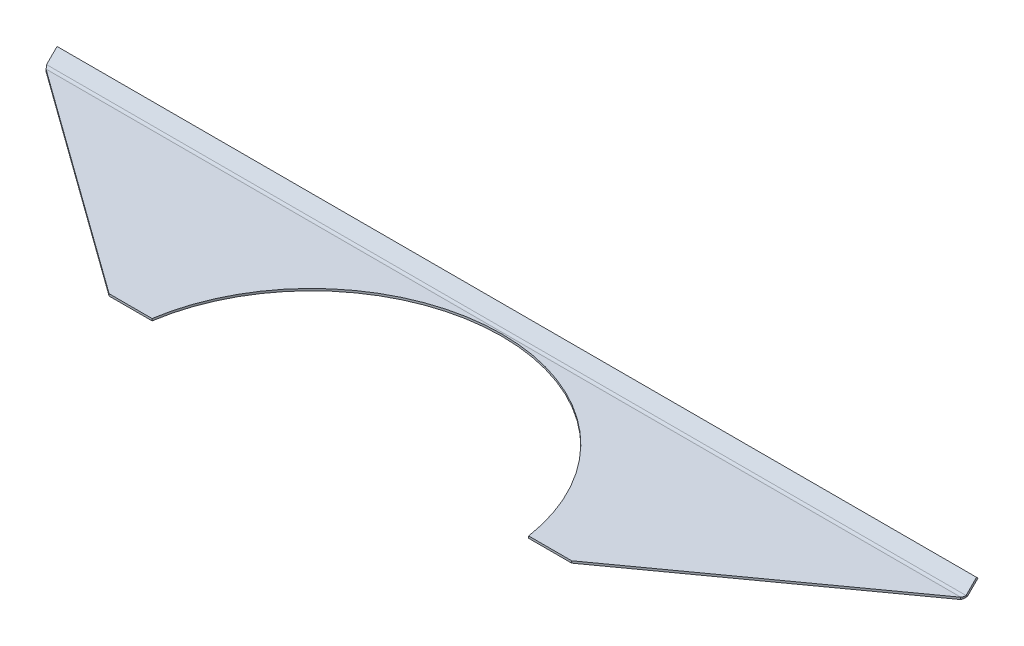
ISO-10303-21;
HEADER;
FILE_DESCRIPTION(('STEP AP214'),'2;1');
FILE_NAME('part.step','',(''),(''),'','','');
FILE_SCHEMA(('AUTOMOTIVE_DESIGN { 1 0 10303 214 1 1 1 1 }'));
ENDSEC;
DATA;
#1=APPLICATION_CONTEXT('core data for automotive mechanical design processes');
#2=APPLICATION_PROTOCOL_DEFINITION('international standard','automotive_design',2000,#1);
#3=PRODUCT_CONTEXT('',#1,'mechanical');
#4=PRODUCT('Part','Part','',(#3));
#5=PRODUCT_RELATED_PRODUCT_CATEGORY('part','',(#4));
#6=PRODUCT_DEFINITION_FORMATION('','',#4);
#7=PRODUCT_DEFINITION_CONTEXT('part definition',#1,'design');
#8=PRODUCT_DEFINITION('design','',#6,#7);
#9=PRODUCT_DEFINITION_SHAPE('','',#8);
#10=(LENGTH_UNIT() NAMED_UNIT(*) SI_UNIT(.MILLI.,.METRE.));
#11=(NAMED_UNIT(*) PLANE_ANGLE_UNIT() SI_UNIT($,.RADIAN.));
#12=(NAMED_UNIT(*) SI_UNIT($,.STERADIAN.) SOLID_ANGLE_UNIT());
#13=UNCERTAINTY_MEASURE_WITH_UNIT(LENGTH_MEASURE(1.E-05),#10,'distance_accuracy_value','');
#14=(GEOMETRIC_REPRESENTATION_CONTEXT(3) GLOBAL_UNCERTAINTY_ASSIGNED_CONTEXT((#13)) GLOBAL_UNIT_ASSIGNED_CONTEXT((#10,
#11,#12)) REPRESENTATION_CONTEXT('',''));
#15=CARTESIAN_POINT('',(0.,0.,0.));
#16=DIRECTION('',(0.,0.,1.));
#17=DIRECTION('',(1.,0.,0.));
#18=AXIS2_PLACEMENT_3D('',#15,#16,#17);
#19=CARTESIAN_POINT('',(0.193817430499996,-1.5875,0.));
#20=DIRECTION('',(0.,1.,0.));
#21=DIRECTION('',(0.,0.,1.));
#22=AXIS2_PLACEMENT_3D('',#19,#20,#21);
#23=PLANE('',#22);
#24=DIRECTION('',(-1.,0.,0.));
#25=VECTOR('',#24,1.);
#26=CARTESIAN_POINT('',(-203.2,-1.58750000000004,-22.225));
#27=LINE('',#26,#25);
#28=CARTESIAN_POINT('',(177.465441421512,-1.5875,-22.225));
#29=VERTEX_POINT('',#28);
#30=CARTESIAN_POINT('',(144.5428800357,-1.5875,-22.225));
#31=VERTEX_POINT('',#30);
#32=EDGE_CURVE('E57',#29,#31,#27,.T.);
#33=ORIENTED_EDGE('',*,*,#32,.T.);
#34=CARTESIAN_POINT('',(0.193817430499996,-1.5875,0.));
#35=DIRECTION('',(0.,-1.,0.));
#36=DIRECTION('',(0.,0.,1.));
#37=AXIS2_PLACEMENT_3D('',#34,#35,#36);
#38=CIRCLE('',#37,146.05);
#39=CARTESIAN_POINT('',(-144.1552451747,-1.5875,-22.225));
#40=VERTEX_POINT('',#39);
#41=EDGE_CURVE('E49',#40,#31,#38,.T.);
#42=ORIENTED_EDGE('',*,*,#41,.F.);
#43=DIRECTION('',(1.,0.,0.));
#44=VECTOR('',#43,1.);
#45=CARTESIAN_POINT('',(0.193817430499996,-1.5875,-22.225));
#46=LINE('',#45,#44);
#47=CARTESIAN_POINT('',(-177.077806560512,-1.5875,-22.225));
#48=VERTEX_POINT('',#47);
#49=EDGE_CURVE('E65',#40,#48,#46,.F.);
#50=ORIENTED_EDGE('',*,*,#49,.T.);
#51=DIRECTION('',(0.811228232083333,0.,0.584729643058182));
#52=VECTOR('',#51,1.);
#53=CARTESIAN_POINT('',(-352.2311825695,-1.5875,-148.474761760819));
#54=LINE('',#53,#52);
#55=CARTESIAN_POINT('',(-350.406631643826,-1.58750000000004,-147.159633700284));
#56=VERTEX_POINT('',#55);
#57=EDGE_CURVE('E137',#56,#48,#54,.T.);
#58=ORIENTED_EDGE('',*,*,#57,.F.);
#59=DIRECTION('',(-1.,0.,0.));
#60=VECTOR('',#59,1.);
#61=CARTESIAN_POINT('',(-352.2311825695,-1.58750000000004,-147.159633700284));
#62=LINE('',#61,#60);
#63=CARTESIAN_POINT('',(350.794266504826,-1.5875,-147.159633700284));
#64=VERTEX_POINT('',#63);
#65=EDGE_CURVE('E195',#56,#64,#62,.F.);
#66=ORIENTED_EDGE('',*,*,#65,.T.);
#67=DIRECTION('',(0.811228232083333,0.,-0.584729643058182));
#68=VECTOR('',#67,1.);
#69=CARTESIAN_POINT('',(146.6314522915,-1.5875,0.));
#70=LINE('',#69,#68);
#71=EDGE_CURVE('E11',#29,#64,#70,.T.);
#72=ORIENTED_EDGE('',*,*,#71,.F.);
#73=EDGE_LOOP('',(#33,#42,#50,#58,#66,#72));
#74=FACE_BOUND('',#73,.T.);
#75=ADVANCED_FACE('F40',(#74),#23,.F.);
#76=CARTESIAN_POINT('',(0.193817430499996,0.,0.));
#77=DIRECTION('',(0.,1.,0.));
#78=DIRECTION('',(0.,0.,1.));
#79=AXIS2_PLACEMENT_3D('',#76,#77,#78);
#80=PLANE('',#79);
#81=CARTESIAN_POINT('',(0.193817430499996,0.,0.));
#82=DIRECTION('',(0.,-1.,0.));
#83=DIRECTION('',(0.,0.,1.));
#84=AXIS2_PLACEMENT_3D('',#81,#82,#83);
#85=CIRCLE('',#84,146.05);
#86=CARTESIAN_POINT('',(-144.1552451747,0.,-22.225));
#87=VERTEX_POINT('',#86);
#88=CARTESIAN_POINT('',(144.5428800357,0.,-22.225));
#89=VERTEX_POINT('',#88);
#90=EDGE_CURVE('E129',#87,#89,#85,.T.);
#91=ORIENTED_EDGE('',*,*,#90,.T.);
#92=DIRECTION('',(1.,0.,0.));
#93=VECTOR('',#92,1.);
#94=CARTESIAN_POINT('',(0.193817430499996,0.,-22.225));
#95=LINE('',#94,#93);
#96=CARTESIAN_POINT('',(177.465441421513,0.,-22.225));
#97=VERTEX_POINT('',#96);
#98=EDGE_CURVE('E116',#97,#89,#95,.F.);
#99=ORIENTED_EDGE('',*,*,#98,.F.);
#100=DIRECTION('',(0.811228232083333,0.,-0.584729643058182));
#101=VECTOR('',#100,1.);
#102=CARTESIAN_POINT('',(146.6314522915,0.,0.));
#103=LINE('',#102,#101);
#104=CARTESIAN_POINT('',(350.794266504826,0.,-147.159633700284));
#105=VERTEX_POINT('',#104);
#106=EDGE_CURVE('E44',#97,#105,#103,.T.);
#107=ORIENTED_EDGE('',*,*,#106,.T.);
#108=DIRECTION('',(-1.,0.,0.));
#109=VECTOR('',#108,1.);
#110=CARTESIAN_POINT('',(-352.2311825695,0.,-147.159633700284));
#111=LINE('',#110,#109);
#112=CARTESIAN_POINT('',(-350.406631643826,0.,-147.159633700284));
#113=VERTEX_POINT('',#112);
#114=EDGE_CURVE('E152',#113,#105,#111,.F.);
#115=ORIENTED_EDGE('',*,*,#114,.F.);
#116=DIRECTION('',(0.811228232083333,0.,0.584729643058182));
#117=VECTOR('',#116,1.);
#118=CARTESIAN_POINT('',(-352.2311825695,0.,-148.474761760819));
#119=LINE('',#118,#117);
#120=CARTESIAN_POINT('',(-177.077806560512,0.,-22.225));
#121=VERTEX_POINT('',#120);
#122=EDGE_CURVE('E136',#113,#121,#119,.T.);
#123=ORIENTED_EDGE('',*,*,#122,.T.);
#124=DIRECTION('',(-1.,0.,0.));
#125=VECTOR('',#124,1.);
#126=CARTESIAN_POINT('',(-203.2,0.,-22.225));
#127=LINE('',#126,#125);
#128=EDGE_CURVE('E131',#87,#121,#127,.T.);
#129=ORIENTED_EDGE('',*,*,#128,.F.);
#130=EDGE_LOOP('',(#91,#99,#107,#115,#123,#129));
#131=FACE_BOUND('',#130,.T.);
#132=ADVANCED_FACE('F134',(#131),#80,.T.);
#133=CARTESIAN_POINT('',(0.193817430499996,-1.5875,0.));
#134=DIRECTION('',(0.,1.,0.));
#135=DIRECTION('',(0.,0.,1.));
#136=AXIS2_PLACEMENT_3D('',#133,#134,#135);
#137=CYLINDRICAL_SURFACE('',#136,146.05);
#138=ORIENTED_EDGE('',*,*,#41,.T.);
#139=DIRECTION('',(0.,-1.,0.));
#140=VECTOR('',#139,1.);
#141=CARTESIAN_POINT('',(144.5428800357,-1.5875,-22.225));
#142=LINE('',#141,#140);
#143=EDGE_CURVE('E119',#31,#89,#142,.F.);
#144=ORIENTED_EDGE('',*,*,#143,.T.);
#145=ORIENTED_EDGE('',*,*,#90,.F.);
#146=DIRECTION('',(0.,1.,0.));
#147=VECTOR('',#146,1.);
#148=CARTESIAN_POINT('',(-144.1552451747,0.,-22.225));
#149=LINE('',#148,#147);
#150=EDGE_CURVE('E227',#87,#40,#149,.F.);
#151=ORIENTED_EDGE('',*,*,#150,.T.);
#152=EDGE_LOOP('',(#138,#144,#145,#151));
#153=FACE_BOUND('',#152,.T.);
#154=ADVANCED_FACE('F128',(#153),#137,.F.);
#155=CARTESIAN_POINT('',(146.6314522915,-1.5875,0.));
#156=DIRECTION('',(0.584729643058182,0.,0.811228232083333));
#157=DIRECTION('',(0.811228232083333,0.,-0.584729643058182));
#158=AXIS2_PLACEMENT_3D('',#155,#156,#157);
#159=PLANE('',#158);
#160=ORIENTED_EDGE('',*,*,#106,.F.);
#161=DIRECTION('',(0.,-1.,0.));
#162=VECTOR('',#161,1.);
#163=CARTESIAN_POINT('',(177.465441421513,-1.58750000000004,-22.225));
#164=LINE('',#163,#162);
#165=EDGE_CURVE('E120',#29,#97,#164,.F.);
#166=ORIENTED_EDGE('',*,*,#165,.F.);
#167=ORIENTED_EDGE('',*,*,#71,.T.);
#168=DIRECTION('',(0.,-1.,0.));
#169=VECTOR('',#168,1.);
#170=CARTESIAN_POINT('',(350.794266504826,0.,-147.159633700284));
#171=LINE('',#170,#169);
#172=EDGE_CURVE('E138',#105,#64,#171,.T.);
#173=ORIENTED_EDGE('',*,*,#172,.F.);
#174=EDGE_LOOP('',(#160,#166,#167,#173));
#175=FACE_BOUND('',#174,.T.);
#176=ADVANCED_FACE('F292',(#175),#159,.T.);
#177=CARTESIAN_POINT('',(-352.2311825695,-1.5875,-148.474761760819));
#178=DIRECTION('',(-0.584729643058182,0.,0.811228232083333));
#179=DIRECTION('',(0.811228232083333,0.,0.584729643058182));
#180=AXIS2_PLACEMENT_3D('',#177,#178,#179);
#181=PLANE('',#180);
#182=ORIENTED_EDGE('',*,*,#57,.T.);
#183=DIRECTION('',(0.,1.,0.));
#184=VECTOR('',#183,1.);
#185=CARTESIAN_POINT('',(-177.077806560512,0.,-22.225));
#186=LINE('',#185,#184);
#187=EDGE_CURVE('E229',#121,#48,#186,.F.);
#188=ORIENTED_EDGE('',*,*,#187,.F.);
#189=ORIENTED_EDGE('',*,*,#122,.F.);
#190=DIRECTION('',(0.,-1.,0.));
#191=VECTOR('',#190,1.);
#192=CARTESIAN_POINT('',(-350.406631643826,0.,-147.159633700284));
#193=LINE('',#192,#191);
#194=EDGE_CURVE('E194',#113,#56,#193,.T.);
#195=ORIENTED_EDGE('',*,*,#194,.T.);
#196=EDGE_LOOP('',(#182,#188,#189,#195));
#197=FACE_BOUND('',#196,.T.);
#198=ADVANCED_FACE('F42',(#197),#181,.T.);
#199=CARTESIAN_POINT('',(350.794266504826,-1.60337499999999,-147.159633700284));
#200=CARTESIAN_POINT('',(351.098402700509,-1.60337499999999,-147.785212740502));
#201=CARTESIAN_POINT('',(351.402450146718,-1.47900668887496,-148.410363247209));
#202=CARTESIAN_POINT('',(352.010633788609,-1.00027903345227,-149.566114045614));
#203=CARTESIAN_POINT('',(352.314681234817,-0.64617254705847,-150.09610388433));
#204=CARTESIAN_POINT('',(352.6188174305,-0.203821365552261,-150.538455065836));
#205=CARTESIAN_POINT('',(350.794266504826,-1.58749999999999,-147.159633700284));
#206=CARTESIAN_POINT('',(351.098402614715,-1.58749999999999,-147.783134287953));
#207=CARTESIAN_POINT('',(351.402450146718,-1.46354487263285,-148.406207999545));
#208=CARTESIAN_POINT('',(352.010633788609,-0.986407674537149,-149.5581190943));
#209=CARTESIAN_POINT('',(352.314681320612,-0.633477539015848,-150.08634825207));
#210=CARTESIAN_POINT('',(352.6188174305,-0.192596045400925,-150.527229745685));
#211=CARTESIAN_POINT('',(350.794266504826,0.,-147.159633700284));
#212=CARTESIAN_POINT('',(351.098394035298,0.,-147.575289033122));
#213=CARTESIAN_POINT('',(351.402450146718,0.0826367515781052,-147.990683233125));
#214=CARTESIAN_POINT('',(352.010633788609,0.40072821697524,-148.758623962962));
#215=CARTESIAN_POINT('',(352.314689900028,0.636023265246396,-149.110785026065));
#216=CARTESIAN_POINT('',(352.6188174305,0.929935969732723,-149.404697730551));
#217=CARTESIAN_POINT('',(350.794266504826,0.0160337500000069,-147.159633700284));
#218=CARTESIAN_POINT('',(351.098393948646,0.0160337500000069,-147.573189796049));
#219=CARTESIAN_POINT('',(351.402450146718,0.0982531859826358,-147.986486432984));
#220=CARTESIAN_POINT('',(352.010633788609,0.414738289479515,-148.750549062135));
#221=CARTESIAN_POINT('',(352.31468998668,0.648845223369445,-149.100931837482));
#222=CARTESIAN_POINT('',(352.6188174305,0.941273543085573,-149.393360157198));
#223=B_SPLINE_SURFACE_WITH_KNOTS('',1,3,((#199,#200,#201,#202,#203,#204),(#205,#206,#207,#208,
#209,#210),(#211,#212,#213,#214,#215,#216),(#217,#218,#219,#220,#221,#222)),.UNSPECIFIED.,.F.,
.F.,.F.,(2,1,1,2),(4,2,4),(-0.01,0.,1.,1.0101),(0.,0.5,1.),.UNSPECIFIED.);
#224=DIRECTION('',(0.,-0.707106781186551,-0.707106781186544));
#225=VECTOR('',#224,1.);
#226=CARTESIAN_POINT('',(352.6188174305,0.929935969732718,-149.404697730551));
#227=LINE('',#226,#225);
#228=CARTESIAN_POINT('',(352.6188174305,0.929935969732718,-149.404697730551));
#229=VERTEX_POINT('',#228);
#230=CARTESIAN_POINT('',(352.6188174305,-0.192596045400929,-150.527229745685));
#231=VERTEX_POINT('',#230);
#232=EDGE_CURVE('E234',#229,#231,#227,.T.);
#233=CARTESIAN_POINT('',(350.794266504826,0.,-147.159633700284));
#234=CARTESIAN_POINT('',(350.874092618561,-2.16495811624445E-05,-147.268726582998));
#235=CARTESIAN_POINT('',(350.953915580089,0.00562164434472559,-147.37781840919));
#236=CARTESIAN_POINT('',(351.113514977078,0.0280782573932783,-147.594788958531));
#237=CARTESIAN_POINT('',(351.193291414189,0.0448854877517528,-147.702668310362));
#238=CARTESIAN_POINT('',(351.352851558573,0.0895123907407566,-147.916133725762));
#239=CARTESIAN_POINT('',(351.432635265869,0.117333032673918,-148.021719586616));
#240=CARTESIAN_POINT('',(351.592237538962,0.18369788114791,-148.229508733181));
#241=CARTESIAN_POINT('',(351.672056106751,0.222246043726966,-148.33171075543));
#242=CARTESIAN_POINT('',(351.823998930517,0.3054389651289,-148.521971363189));
#243=CARTESIAN_POINT('',(351.896123854382,0.349138994201814,-148.61044411284));
#244=CARTESIAN_POINT('',(352.04039501697,0.444595923935233,-148.782976559996));
#245=CARTESIAN_POINT('',(352.112541254678,0.496355536493873,-148.867034759309));
#246=CARTESIAN_POINT('',(352.257050511619,0.607639109949298,-149.030210824732));
#247=CARTESIAN_POINT('',(352.329413534258,0.667185815686344,-149.10931317347));
#248=CARTESIAN_POINT('',(352.474122898102,0.793372721653697,-149.261603542027));
#249=CARTESIAN_POINT('',(352.546469238666,0.860011044829545,-149.334793117898));
#250=CARTESIAN_POINT('',(352.6188174305,0.929935969732723,-149.404697730551));
#251=B_SPLINE_CURVE_WITH_KNOTS('',3,(#233,#234,#235,#236,#237,#238,#239,#240,#241,#242,#243,
#244,#245,#246,#247,#248,#249,#250),.UNSPECIFIED.,.F.,.F.,(4,2,2,2,2,2,2,2,4),(0.,
0.405416763424114,0.810612595597231,1.21584409743855,1.6212252368886,1.98756386072292,
2.35402601804371,2.72158351255081,3.08904396044003),.UNSPECIFIED.);
#252=EDGE_CURVE('E154',#105,#229,#251,.T.);
#253=CARTESIAN_POINT('',(350.794266504826,-1.58749999999999,-147.159633700284));
#254=CARTESIAN_POINT('',(350.867104149607,-1.58752215778612,-147.308948616645));
#255=CARTESIAN_POINT('',(350.939939504606,-1.58047888830925,-147.458260985646));
#256=CARTESIAN_POINT('',(351.0856318172,-1.55241583465988,-147.755619536587));
#257=CARTESIAN_POINT('',(351.158488773765,-1.53139132156875,-147.903665272945));
#258=CARTESIAN_POINT('',(351.303918660829,-1.47562864525099,-148.196557652796));
#259=CARTESIAN_POINT('',(351.376491597173,-1.4409439757979,-148.341414475345));
#260=CARTESIAN_POINT('',(351.521610074231,-1.35819238245073,-148.627179047767));
#261=CARTESIAN_POINT('',(351.594155613089,-1.3101313015747,-148.768088492401));
#262=CARTESIAN_POINT('',(351.744709866891,-1.19692792113671,-149.055212495214));
#263=CARTESIAN_POINT('',(351.822718996428,-1.13077259699641,-149.201028658547));
#264=CARTESIAN_POINT('',(351.978697240124,-0.984168028007746,-149.485206249622));
#265=CARTESIAN_POINT('',(352.056666357064,-0.903724942926394,-149.623570856526));
#266=CARTESIAN_POINT('',(352.215300051601,-0.726314716996739,-149.896140829695));
#267=CARTESIAN_POINT('',(352.295964711264,-0.628872800374857,-150.030037459677));
#268=CARTESIAN_POINT('',(352.457357859172,-0.420541775989595,-150.28708698115));
#269=CARTESIAN_POINT('',(352.53808635027,-0.309642721081422,-150.410231808169));
#270=CARTESIAN_POINT('',(352.6188174305,-0.192596045400925,-150.527229745685));
#271=B_SPLINE_CURVE_WITH_KNOTS('',3,(#253,#254,#255,#256,#257,#258,#259,#260,#261,#262,#263,
#264,#265,#266,#267,#268,#269,#270),.UNSPECIFIED.,.F.,.F.,(4,2,2,2,2,2,2,2,4),(0.,
0.498245930787357,0.996660470587558,1.49314230056478,1.98940759925231,2.52300737601263,
3.05637766214689,3.6081707729769,4.16037426739532),.UNSPECIFIED.);
#272=EDGE_CURVE('E188',#64,#231,#271,.T.);
#273=ORIENTED_EDGE('',*,*,#232,.F.);
#274=ORIENTED_EDGE('',*,*,#252,.F.);
#275=ORIENTED_EDGE('',*,*,#172,.T.);
#276=ORIENTED_EDGE('',*,*,#272,.T.);
#277=EDGE_LOOP('',(#273,#274,#275,#276));
#278=FACE_BOUND('',#277,.T.);
#279=ADVANCED_FACE('F174',(#278),#223,.F.);
#280=CARTESIAN_POINT('',(-352.2311825695,-0.203821365552304,-150.538455065836));
#281=CARTESIAN_POINT('',(-351.927046373817,-0.646172547058517,-150.09610388433));
#282=CARTESIAN_POINT('',(-351.622998927609,-1.00027903345231,-149.566114045614));
#283=CARTESIAN_POINT('',(-351.014815285717,-1.479006688875,-148.410363247209));
#284=CARTESIAN_POINT('',(-350.710767839509,-1.60337500000004,-147.785212740502));
#285=CARTESIAN_POINT('',(-350.406631643826,-1.60337500000004,-147.159633700284));
#286=CARTESIAN_POINT('',(-352.2311825695,-0.192596045400967,-150.527229745685));
#287=CARTESIAN_POINT('',(-351.927046459611,-0.633477539015896,-150.08634825207));
#288=CARTESIAN_POINT('',(-351.622998927609,-0.986407674537188,-149.5581190943));
#289=CARTESIAN_POINT('',(-351.014815285717,-1.46354487263289,-148.406207999545));
#290=CARTESIAN_POINT('',(-350.710767753715,-1.58750000000004,-147.783134287953));
#291=CARTESIAN_POINT('',(-350.406631643826,-1.58750000000004,-147.159633700284));
#292=CARTESIAN_POINT('',(-352.2311825695,0.92993596973268,-149.404697730551));
#293=CARTESIAN_POINT('',(-351.927055039028,0.636023265246207,-149.110785026065));
#294=CARTESIAN_POINT('',(-351.622998927609,0.400728216975195,-148.758623962962));
#295=CARTESIAN_POINT('',(-351.014815285717,0.0826367515780593,-147.990683233125));
#296=CARTESIAN_POINT('',(-350.710759174298,0.,-147.575289033122));
#297=CARTESIAN_POINT('',(-350.406631643826,0.,-147.159633700284));
#298=CARTESIAN_POINT('',(-352.2311825695,0.94127354308553,-149.393360157198));
#299=CARTESIAN_POINT('',(-351.92705512568,0.648845223369255,-149.100931837482));
#300=CARTESIAN_POINT('',(-351.622998927609,0.41473828947947,-148.750549062135));
#301=CARTESIAN_POINT('',(-351.014815285717,0.0982531859825899,-147.986486432984));
#302=CARTESIAN_POINT('',(-350.710759087646,0.0160337499999618,-147.573189796048));
#303=CARTESIAN_POINT('',(-350.406631643826,0.0160337499999618,-147.159633700284));
#304=B_SPLINE_SURFACE_WITH_KNOTS('',1,3,((#280,#281,#282,#283,#284,#285),(#286,#287,#288,#289,
#290,#291),(#292,#293,#294,#295,#296,#297),(#298,#299,#300,#301,#302,#303)),.UNSPECIFIED.,.F.,
.F.,.F.,(2,1,1,2),(4,2,4),(-0.01,0.,1.,1.0101),(0.,0.5,1.),.UNSPECIFIED.);
#305=CARTESIAN_POINT('',(-352.2311825695,0.92993596973268,-149.404697730551));
#306=CARTESIAN_POINT('',(-352.151356455765,0.852780344020707,-149.327572721971));
#307=CARTESIAN_POINT('',(-352.071533494237,0.779631185351513,-149.246442740495));
#308=CARTESIAN_POINT('',(-351.911934097248,0.642089061963746,-149.077142170369));
#309=CARTESIAN_POINT('',(-351.832157660137,0.577691347293567,-148.98897544258));
#310=CARTESIAN_POINT('',(-351.672597515753,0.458304490242106,-148.806476614075));
#311=CARTESIAN_POINT('',(-351.592813808457,0.403316176602965,-148.7121439713));
#312=CARTESIAN_POINT('',(-351.433211535364,0.303314096398405,-148.518287822318));
#313=CARTESIAN_POINT('',(-351.353392967575,0.258304020577143,-148.418762412173));
#314=CARTESIAN_POINT('',(-351.201450143809,0.182595733507747,-148.225401567364));
#315=CARTESIAN_POINT('',(-351.129325219944,0.150936639174696,-148.13194129924));
#316=CARTESIAN_POINT('',(-350.985054057357,0.0964360181421945,-147.942444193556));
#317=CARTESIAN_POINT('',(-350.912907819648,0.0735974684252947,-147.846406497775));
#318=CARTESIAN_POINT('',(-350.768398562708,0.0369039354623922,-147.652334225962));
#319=CARTESIAN_POINT('',(-350.696035540068,0.0230760076859495,-147.554294539338));
#320=CARTESIAN_POINT('',(-350.551326176225,0.00461807227655389,-147.357381370116));
#321=CARTESIAN_POINT('',(-350.47897983566,-1.43629296001692E-05,-147.2585081145));
#322=CARTESIAN_POINT('',(-350.406631643826,0.,-147.159633700284));
#323=B_SPLINE_CURVE_WITH_KNOTS('',3,(#305,#306,#307,#308,#309,#310,#311,#312,#313,#314,#315,
#316,#317,#318,#319,#320,#321,#322),.UNSPECIFIED.,.F.,.F.,(4,2,2,2,2,2,2,2,4),(0.,
0.405416763424105,0.810612595597257,1.2158440974386,1.62122523688862,1.9875638607229,
2.35402601804364,2.72158351255072,3.08904396043996),.UNSPECIFIED.);
#324=CARTESIAN_POINT('',(-352.2311825695,0.929935969732673,-149.404697730551));
#325=VERTEX_POINT('',#324);
#326=EDGE_CURVE('E144',#325,#113,#323,.T.);
#327=DIRECTION('',(0.,-0.707106781186551,-0.707106781186544));
#328=VECTOR('',#327,1.);
#329=CARTESIAN_POINT('',(-352.2311825695,0.929935969732718,-149.404697730551));
#330=LINE('',#329,#328);
#331=CARTESIAN_POINT('',(-352.2311825695,-0.192596045400933,-150.527229745685));
#332=VERTEX_POINT('',#331);
#333=EDGE_CURVE('E238',#325,#332,#330,.T.);
#334=CARTESIAN_POINT('',(-352.2311825695,-0.19259604540097,-150.527229745685));
#335=CARTESIAN_POINT('',(-352.158344924719,-0.2981933032131,-150.421663823714));
#336=CARTESIAN_POINT('',(-352.08550956972,-0.398792748239649,-150.31110369147));
#337=CARTESIAN_POINT('',(-351.939817257126,-0.589213420517982,-150.080995868119));
#338=CARTESIAN_POINT('',(-351.866960300561,-0.679030988844392,-149.961445148237));
#339=CARTESIAN_POINT('',(-351.721530413497,-0.846707010233338,-149.714908793725));
#340=CARTESIAN_POINT('',(-351.648957477153,-0.924610486785517,-149.587953787226));
#341=CARTESIAN_POINT('',(-351.503839000095,-1.06816234095826,-149.327373507434));
#342=CARTESIAN_POINT('',(-351.431293461237,-1.13381604859357,-149.193751167402));
#343=CARTESIAN_POINT('',(-351.280739207435,-1.2567965000633,-148.91067696001));
#344=CARTESIAN_POINT('',(-351.202730077898,-1.31312521965105,-148.7607904838));
#345=CARTESIAN_POINT('',(-351.046751834202,-1.41040403647676,-148.456181497204));
#346=CARTESIAN_POINT('',(-350.968782717262,-1.45136073733452,-148.301461094425));
#347=CARTESIAN_POINT('',(-350.810149022725,-1.51864883990325,-147.983277044243));
#348=CARTESIAN_POINT('',(-350.729484363063,-1.54442621492613,-147.81969598919));
#349=CARTESIAN_POINT('',(-350.568091215155,-1.57887539458655,-147.490622249381));
#350=CARTESIAN_POINT('',(-350.487362724056,-1.58753446308652,-147.325128233376));
#351=CARTESIAN_POINT('',(-350.406631643826,-1.58750000000004,-147.159633700284));
#352=B_SPLINE_CURVE_WITH_KNOTS('',3,(#334,#335,#336,#337,#338,#339,#340,#341,#342,#343,#344,
#345,#346,#347,#348,#349,#350,#351),.UNSPECIFIED.,.F.,.F.,(4,2,2,2,2,2,2,2,4),(0.,
0.498245930787373,0.996660470587574,1.49314230056485,1.98940759925234,2.5230073760126,
3.0563776621468,3.60817077297685,4.16037426739527),.UNSPECIFIED.);
#353=EDGE_CURVE('E197',#332,#56,#352,.T.);
#354=ORIENTED_EDGE('',*,*,#326,.F.);
#355=ORIENTED_EDGE('',*,*,#333,.T.);
#356=ORIENTED_EDGE('',*,*,#353,.T.);
#357=ORIENTED_EDGE('',*,*,#194,.F.);
#358=EDGE_LOOP('',(#354,#355,#356,#357));
#359=FACE_BOUND('',#358,.T.);
#360=ADVANCED_FACE('F160',(#359),#304,.F.);
#361=CARTESIAN_POINT('',(-352.2311825695,3.175,-147.159633700284));
#362=DIRECTION('',(-1.,0.,0.));
#363=DIRECTION('',(0.,-0.707106781186551,-0.707106781186544));
#364=AXIS2_PLACEMENT_3D('',#361,#362,#363);
#365=CYLINDRICAL_SURFACE('',#364,4.76250000000004);
#366=ORIENTED_EDGE('',*,*,#65,.F.);
#367=ORIENTED_EDGE('',*,*,#353,.F.);
#368=DIRECTION('',(-1.,0.,0.));
#369=VECTOR('',#368,1.);
#370=CARTESIAN_POINT('',(0.,-0.192596045400964,-150.527229745685));
#371=LINE('',#370,#369);
#372=EDGE_CURVE('E240',#231,#332,#371,.T.);
#373=ORIENTED_EDGE('',*,*,#372,.F.);
#374=ORIENTED_EDGE('',*,*,#272,.F.);
#375=EDGE_LOOP('',(#366,#367,#373,#374));
#376=FACE_BOUND('',#375,.T.);
#377=ADVANCED_FACE('F170',(#376),#365,.T.);
#378=CARTESIAN_POINT('',(-352.2311825695,3.175,-147.159633700284));
#379=DIRECTION('',(-1.,0.,0.));
#380=DIRECTION('',(0.,-0.707106781186551,-0.707106781186544));
#381=AXIS2_PLACEMENT_3D('',#378,#379,#380);
#382=CYLINDRICAL_SURFACE('',#381,3.17500000000004);
#383=ORIENTED_EDGE('',*,*,#114,.T.);
#384=ORIENTED_EDGE('',*,*,#252,.T.);
#385=DIRECTION('',(-1.,0.,0.));
#386=VECTOR('',#385,1.);
#387=CARTESIAN_POINT('',(352.6188174305,0.929935969732718,-149.404697730551));
#388=LINE('',#387,#386);
#389=EDGE_CURVE('E236',#229,#325,#388,.T.);
#390=ORIENTED_EDGE('',*,*,#389,.T.);
#391=ORIENTED_EDGE('',*,*,#326,.T.);
#392=EDGE_LOOP('',(#383,#384,#390,#391));
#393=FACE_BOUND('',#392,.T.);
#394=ADVANCED_FACE('F165',(#393),#382,.F.);
#395=CARTESIAN_POINT('',(-352.2311825695,-1.12253201513365,-149.597293775952));
#396=DIRECTION('',(-1.,0.,0.));
#397=DIRECTION('',(0.,0.,1.));
#398=AXIS2_PLACEMENT_3D('',#395,#396,#397);
#399=PLANE('',#398);
#400=DIRECTION('',(0.,-0.707106781186544,0.707106781186551));
#401=VECTOR('',#400,1.);
#402=CARTESIAN_POINT('',(-352.2311825695,-1.12253201513365,-149.597293775952));
#403=LINE('',#402,#401);
#404=CARTESIAN_POINT('',(-352.2311825695,7.85772410593546,-158.577549897021));
#405=VERTEX_POINT('',#404);
#406=EDGE_CURVE('E252',#405,#332,#403,.T.);
#407=ORIENTED_EDGE('',*,*,#406,.T.);
#408=ORIENTED_EDGE('',*,*,#333,.F.);
#409=DIRECTION('',(0.,-0.707106781186544,0.707106781186551));
#410=VECTOR('',#409,1.);
#411=CARTESIAN_POINT('',(-352.2311825695,0.,-148.474761760819));
#412=LINE('',#411,#410);
#413=CARTESIAN_POINT('',(-352.2311825695,8.98025612106911,-157.455017881888));
#414=VERTEX_POINT('',#413);
#415=EDGE_CURVE('E249',#414,#325,#412,.T.);
#416=ORIENTED_EDGE('',*,*,#415,.F.);
#417=DIRECTION('',(0.,0.707106781186551,0.707106781186544));
#418=VECTOR('',#417,1.);
#419=CARTESIAN_POINT('',(-352.2311825695,7.85772410593546,-158.577549897021));
#420=LINE('',#419,#418);
#421=EDGE_CURVE('E153',#405,#414,#420,.T.);
#422=ORIENTED_EDGE('',*,*,#421,.F.);
#423=EDGE_LOOP('',(#407,#408,#416,#422));
#424=FACE_BOUND('',#423,.T.);
#425=ADVANCED_FACE('F169',(#424),#399,.T.);
#426=CARTESIAN_POINT('',(352.6188174305,7.85772410593546,-158.577549897021));
#427=DIRECTION('',(1.,0.,0.));
#428=DIRECTION('',(0.,0.,-1.));
#429=AXIS2_PLACEMENT_3D('',#426,#427,#428);
#430=PLANE('',#429);
#431=DIRECTION('',(0.,0.707106781186544,-0.707106781186551));
#432=VECTOR('',#431,1.);
#433=CARTESIAN_POINT('',(352.6188174305,8.98025612106911,-157.455017881888));
#434=LINE('',#433,#432);
#435=CARTESIAN_POINT('',(352.6188174305,8.98025612106911,-157.455017881888));
#436=VERTEX_POINT('',#435);
#437=EDGE_CURVE('E245',#229,#436,#434,.T.);
#438=ORIENTED_EDGE('',*,*,#437,.F.);
#439=ORIENTED_EDGE('',*,*,#232,.T.);
#440=DIRECTION('',(0.,0.707106781186544,-0.707106781186551));
#441=VECTOR('',#440,1.);
#442=CARTESIAN_POINT('',(352.6188174305,7.85772410593546,-158.577549897021));
#443=LINE('',#442,#441);
#444=CARTESIAN_POINT('',(352.6188174305,7.85772410593546,-158.577549897021));
#445=VERTEX_POINT('',#444);
#446=EDGE_CURVE('E246',#231,#445,#443,.T.);
#447=ORIENTED_EDGE('',*,*,#446,.T.);
#448=DIRECTION('',(0.,0.707106781186551,0.707106781186544));
#449=VECTOR('',#448,1.);
#450=CARTESIAN_POINT('',(352.6188174305,7.85772410593546,-158.577549897021));
#451=LINE('',#450,#449);
#452=EDGE_CURVE('E213',#445,#436,#451,.T.);
#453=ORIENTED_EDGE('',*,*,#452,.T.);
#454=EDGE_LOOP('',(#438,#439,#447,#453));
#455=FACE_BOUND('',#454,.T.);
#456=ADVANCED_FACE('F266',(#455),#430,.T.);
#457=CARTESIAN_POINT('',(0.,-75.359912895543,-75.3599128955421));
#458=DIRECTION('',(0.,-0.707106781186551,-0.707106781186544));
#459=DIRECTION('',(0.,0.707106781186544,-0.707106781186551));
#460=AXIS2_PLACEMENT_3D('',#457,#458,#459);
#461=PLANE('',#460);
#462=ORIENTED_EDGE('',*,*,#446,.F.);
#463=ORIENTED_EDGE('',*,*,#372,.T.);
#464=ORIENTED_EDGE('',*,*,#406,.F.);
#465=DIRECTION('',(-1.,0.,0.));
#466=VECTOR('',#465,1.);
#467=CARTESIAN_POINT('',(-352.2311825695,7.85772410593546,-158.577549897021));
#468=LINE('',#467,#466);
#469=EDGE_CURVE('E248',#445,#405,#468,.T.);
#470=ORIENTED_EDGE('',*,*,#469,.F.);
#471=EDGE_LOOP('',(#462,#463,#464,#470));
#472=FACE_BOUND('',#471,.T.);
#473=ADVANCED_FACE('F277',(#472),#461,.T.);
#474=CARTESIAN_POINT('',(0.,-74.2373808804093,-74.2373808804085));
#475=DIRECTION('',(0.,-0.707106781186551,-0.707106781186544));
#476=DIRECTION('',(0.,0.707106781186544,-0.707106781186551));
#477=AXIS2_PLACEMENT_3D('',#474,#475,#476);
#478=PLANE('',#477);
#479=ORIENTED_EDGE('',*,*,#389,.F.);
#480=ORIENTED_EDGE('',*,*,#437,.T.);
#481=DIRECTION('',(-1.,0.,0.));
#482=VECTOR('',#481,1.);
#483=CARTESIAN_POINT('',(-352.2311825695,8.98025612106911,-157.455017881888));
#484=LINE('',#483,#482);
#485=EDGE_CURVE('E256',#436,#414,#484,.T.);
#486=ORIENTED_EDGE('',*,*,#485,.T.);
#487=ORIENTED_EDGE('',*,*,#415,.T.);
#488=EDGE_LOOP('',(#479,#480,#486,#487));
#489=FACE_BOUND('',#488,.T.);
#490=ADVANCED_FACE('F272',(#489),#478,.F.);
#491=CARTESIAN_POINT('',(-352.2311825695,7.85772410593546,-158.577549897021));
#492=DIRECTION('',(0.,0.707106781186544,-0.707106781186551));
#493=DIRECTION('',(0.,0.707106781186551,0.707106781186544));
#494=AXIS2_PLACEMENT_3D('',#491,#492,#493);
#495=PLANE('',#494);
#496=ORIENTED_EDGE('',*,*,#485,.F.);
#497=ORIENTED_EDGE('',*,*,#452,.F.);
#498=ORIENTED_EDGE('',*,*,#469,.T.);
#499=ORIENTED_EDGE('',*,*,#421,.T.);
#500=EDGE_LOOP('',(#496,#497,#498,#499));
#501=FACE_BOUND('',#500,.T.);
#502=ADVANCED_FACE('F269',(#501),#495,.T.);
#503=CARTESIAN_POINT('',(-203.2,0.,-22.225));
#504=DIRECTION('',(0.,0.,-1.));
#505=DIRECTION('',(-1.,0.,0.));
#506=AXIS2_PLACEMENT_3D('',#503,#504,#505);
#507=PLANE('',#506);
#508=ORIENTED_EDGE('',*,*,#128,.T.);
#509=ORIENTED_EDGE('',*,*,#187,.T.);
#510=ORIENTED_EDGE('',*,*,#49,.F.);
#511=ORIENTED_EDGE('',*,*,#150,.F.);
#512=EDGE_LOOP('',(#508,#509,#510,#511));
#513=FACE_BOUND('',#512,.T.);
#514=ADVANCED_FACE('F360',(#513),#507,.F.);
#515=CARTESIAN_POINT('',(-203.2,-1.58750000000004,-22.225));
#516=DIRECTION('',(0.,0.,-1.));
#517=DIRECTION('',(-1.,0.,0.));
#518=AXIS2_PLACEMENT_3D('',#515,#516,#517);
#519=PLANE('',#518);
#520=ORIENTED_EDGE('',*,*,#143,.F.);
#521=ORIENTED_EDGE('',*,*,#32,.F.);
#522=ORIENTED_EDGE('',*,*,#165,.T.);
#523=ORIENTED_EDGE('',*,*,#98,.T.);
#524=EDGE_LOOP('',(#520,#521,#522,#523));
#525=FACE_BOUND('',#524,.T.);
#526=ADVANCED_FACE('F118',(#525),#519,.F.);
#527=CLOSED_SHELL('',(#75,#132,#154,#176,#198,#279,#360,#377,#394,#425,#456,#473,#490,#502,#514,#526));
#528=MANIFOLD_SOLID_BREP('B2',#527);
#529=ADVANCED_BREP_SHAPE_REPRESENTATION('',(#18,#528),#14);
#530=SHAPE_DEFINITION_REPRESENTATION(#9,#529);
ENDSEC;
END-ISO-10303-21;
